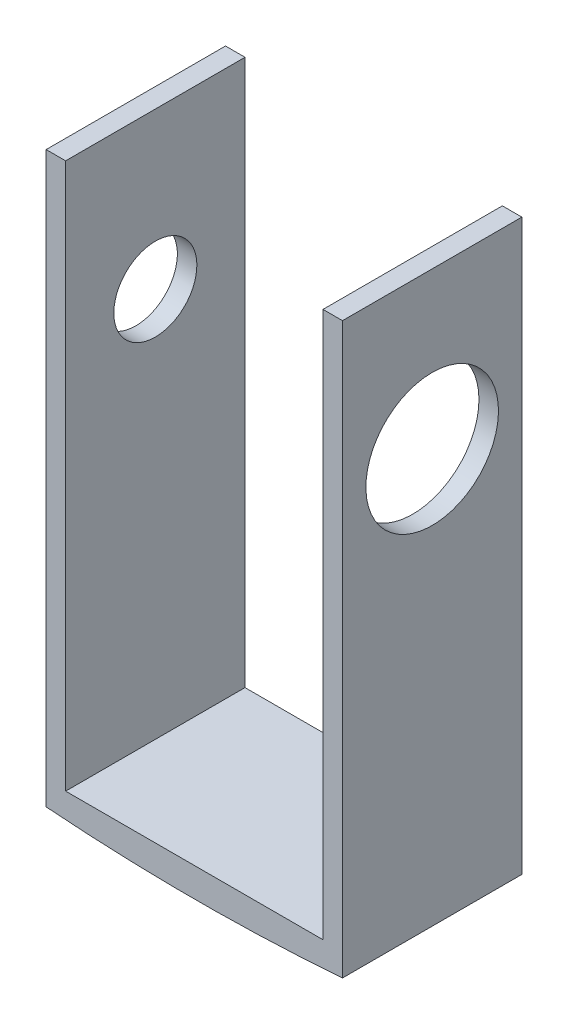
ISO-10303-21;
HEADER;
FILE_DESCRIPTION(('STEP AP214'),'2;1');
FILE_NAME('part.step','',(''),(''),'','','');
FILE_SCHEMA(('AUTOMOTIVE_DESIGN { 1 0 10303 214 1 1 1 1 }'));
ENDSEC;
DATA;
#1=APPLICATION_CONTEXT('core data for automotive mechanical design processes');
#2=APPLICATION_PROTOCOL_DEFINITION('international standard','automotive_design',2000,#1);
#3=PRODUCT_CONTEXT('',#1,'mechanical');
#4=PRODUCT('Part','Part','',(#3));
#5=PRODUCT_RELATED_PRODUCT_CATEGORY('part','',(#4));
#6=PRODUCT_DEFINITION_FORMATION('','',#4);
#7=PRODUCT_DEFINITION_CONTEXT('part definition',#1,'design');
#8=PRODUCT_DEFINITION('design','',#6,#7);
#9=PRODUCT_DEFINITION_SHAPE('','',#8);
#10=(LENGTH_UNIT() NAMED_UNIT(*) SI_UNIT(.MILLI.,.METRE.));
#11=(NAMED_UNIT(*) PLANE_ANGLE_UNIT() SI_UNIT($,.RADIAN.));
#12=(NAMED_UNIT(*) SI_UNIT($,.STERADIAN.) SOLID_ANGLE_UNIT());
#13=UNCERTAINTY_MEASURE_WITH_UNIT(LENGTH_MEASURE(1.E-05),#10,'distance_accuracy_value','');
#14=(GEOMETRIC_REPRESENTATION_CONTEXT(3) GLOBAL_UNCERTAINTY_ASSIGNED_CONTEXT((#13)) GLOBAL_UNIT_ASSIGNED_CONTEXT((#10,
#11,#12)) REPRESENTATION_CONTEXT('',''));
#15=CARTESIAN_POINT('',(0.,0.,0.));
#16=DIRECTION('',(0.,0.,1.));
#17=DIRECTION('',(1.,0.,0.));
#18=AXIS2_PLACEMENT_3D('',#15,#16,#17);
#19=CARTESIAN_POINT('',(-2.39943661770775,16.2501866197183,5.842));
#20=DIRECTION('',(0.,-1.,0.));
#21=DIRECTION('',(0.,0.,-1.));
#22=AXIS2_PLACEMENT_3D('',#19,#20,#21);
#23=PLANE('',#22);
#24=DIRECTION('',(-1.,0.,0.));
#25=VECTOR('',#24,1.);
#26=CARTESIAN_POINT('',(-2.39943661770775,16.2501866197183,0.));
#27=LINE('',#26,#25);
#28=CARTESIAN_POINT('',(-2.39943661770775,16.2501866197183,0.));
#29=VERTEX_POINT('',#28);
#30=CARTESIAN_POINT('',(-3.03443661770775,16.2501866197183,0.));
#31=VERTEX_POINT('',#30);
#32=EDGE_CURVE('E140',#29,#31,#27,.T.);
#33=ORIENTED_EDGE('',*,*,#32,.T.);
#34=DIRECTION('',(0.,0.,-1.));
#35=VECTOR('',#34,1.);
#36=CARTESIAN_POINT('',(-3.03443661770775,16.2501866197183,5.842));
#37=LINE('',#36,#35);
#38=CARTESIAN_POINT('',(-3.03443661770775,16.2501866197183,5.842));
#39=VERTEX_POINT('',#38);
#40=EDGE_CURVE('E11',#39,#31,#37,.T.);
#41=ORIENTED_EDGE('',*,*,#40,.F.);
#42=DIRECTION('',(-1.,0.,0.));
#43=VECTOR('',#42,1.);
#44=CARTESIAN_POINT('',(-2.39943661770775,16.2501866197183,5.842));
#45=LINE('',#44,#43);
#46=CARTESIAN_POINT('',(-2.39943661770775,16.2501866197183,5.842));
#47=VERTEX_POINT('',#46);
#48=EDGE_CURVE('E160',#47,#39,#45,.T.);
#49=ORIENTED_EDGE('',*,*,#48,.F.);
#50=DIRECTION('',(0.,0.,-1.));
#51=VECTOR('',#50,1.);
#52=CARTESIAN_POINT('',(-2.39943661770775,16.2501866197183,5.842));
#53=LINE('',#52,#51);
#54=EDGE_CURVE('E136',#47,#29,#53,.T.);
#55=ORIENTED_EDGE('',*,*,#54,.T.);
#56=EDGE_LOOP('',(#33,#41,#49,#55));
#57=FACE_BOUND('',#56,.T.);
#58=ADVANCED_FACE('F39',(#57),#23,.F.);
#59=CARTESIAN_POINT('',(-3.03443661770775,16.2501866197183,5.842));
#60=DIRECTION('',(1.,0.,0.));
#61=DIRECTION('',(0.,1.,0.));
#62=AXIS2_PLACEMENT_3D('',#59,#60,#61);
#63=PLANE('',#62);
#64=CARTESIAN_POINT('',(-3.03443661770775,11.1701866197183,2.921));
#65=DIRECTION('',(-1.,0.,0.));
#66=DIRECTION('',(0.,0.,1.));
#67=AXIS2_PLACEMENT_3D('',#64,#65,#66);
#68=CIRCLE('',#67,1.35254999999999);
#69=CARTESIAN_POINT('',(-3.03443661770775,11.1701866197183,4.27354999999999));
#70=VERTEX_POINT('',#69);
#71=EDGE_CURVE('E333',#70,#70,#68,.T.);
#72=ORIENTED_EDGE('',*,*,#71,.F.);
#73=EDGE_LOOP('',(#72));
#74=FACE_BOUND('',#73,.T.);
#75=DIRECTION('',(0.,-1.,0.));
#76=VECTOR('',#75,1.);
#77=CARTESIAN_POINT('',(-3.03443661770775,16.2501866197183,0.));
#78=LINE('',#77,#76);
#79=CARTESIAN_POINT('',(-3.03443661770775,-2.29181338028169,0.));
#80=VERTEX_POINT('',#79);
#81=EDGE_CURVE('E144',#31,#80,#78,.T.);
#82=ORIENTED_EDGE('',*,*,#81,.T.);
#83=DIRECTION('',(0.,0.,-1.));
#84=VECTOR('',#83,1.);
#85=CARTESIAN_POINT('',(-3.03443661770775,-2.29181338028169,5.842));
#86=LINE('',#85,#84);
#87=CARTESIAN_POINT('',(-3.03443661770775,-2.29181338028169,5.842));
#88=VERTEX_POINT('',#87);
#89=EDGE_CURVE('E49',#88,#80,#86,.T.);
#90=ORIENTED_EDGE('',*,*,#89,.F.);
#91=DIRECTION('',(0.,-1.,0.));
#92=VECTOR('',#91,1.);
#93=CARTESIAN_POINT('',(-3.03443661770775,16.2501866197183,5.842));
#94=LINE('',#93,#92);
#95=EDGE_CURVE('E98',#39,#88,#94,.T.);
#96=ORIENTED_EDGE('',*,*,#95,.F.);
#97=ORIENTED_EDGE('',*,*,#40,.T.);
#98=EDGE_LOOP('',(#82,#90,#96,#97));
#99=FACE_BOUND('',#98,.T.);
#100=ADVANCED_FACE('F227',(#74,#99),#63,.F.);
#101=CARTESIAN_POINT('',(6.61756338229225,-2.29181338028169,5.842));
#102=DIRECTION('',(-1.,0.,0.));
#103=DIRECTION('',(0.,-1.,0.));
#104=AXIS2_PLACEMENT_3D('',#101,#102,#103);
#105=PLANE('',#104);
#106=CARTESIAN_POINT('',(6.61756338229225,11.1701866197183,2.921));
#107=DIRECTION('',(1.,0.,0.));
#108=DIRECTION('',(0.,1.,0.));
#109=AXIS2_PLACEMENT_3D('',#106,#107,#108);
#110=CIRCLE('',#109,2.159);
#111=CARTESIAN_POINT('',(6.61756338229225,13.3291866197183,2.921));
#112=VERTEX_POINT('',#111);
#113=EDGE_CURVE('E196',#112,#112,#110,.T.);
#114=ORIENTED_EDGE('',*,*,#113,.F.);
#115=EDGE_LOOP('',(#114));
#116=FACE_BOUND('',#115,.T.);
#117=DIRECTION('',(0.,1.,0.));
#118=VECTOR('',#117,1.);
#119=CARTESIAN_POINT('',(6.61756338229225,-2.29181338028169,0.));
#120=LINE('',#119,#118);
#121=CARTESIAN_POINT('',(6.61756338229219,-2.29181338028169,0.));
#122=VERTEX_POINT('',#121);
#123=CARTESIAN_POINT('',(6.61756338229225,16.2501866197183,0.));
#124=VERTEX_POINT('',#123);
#125=EDGE_CURVE('E148',#122,#124,#120,.T.);
#126=ORIENTED_EDGE('',*,*,#125,.T.);
#127=DIRECTION('',(0.,0.,-1.));
#128=VECTOR('',#127,1.);
#129=CARTESIAN_POINT('',(6.61756338229225,16.2501866197183,5.842));
#130=LINE('',#129,#128);
#131=CARTESIAN_POINT('',(6.61756338229225,16.2501866197183,5.842));
#132=VERTEX_POINT('',#131);
#133=EDGE_CURVE('E167',#132,#124,#130,.T.);
#134=ORIENTED_EDGE('',*,*,#133,.F.);
#135=DIRECTION('',(0.,1.,0.));
#136=VECTOR('',#135,1.);
#137=CARTESIAN_POINT('',(6.61756338229225,-2.29181338028169,5.842));
#138=LINE('',#137,#136);
#139=CARTESIAN_POINT('',(6.61756338229225,-2.29181338028169,5.842));
#140=VERTEX_POINT('',#139);
#141=EDGE_CURVE('E203',#140,#132,#138,.T.);
#142=ORIENTED_EDGE('',*,*,#141,.F.);
#143=DIRECTION('',(0.,0.,-1.));
#144=VECTOR('',#143,1.);
#145=CARTESIAN_POINT('',(6.61756338229225,-2.29181338028169,5.842));
#146=LINE('',#145,#144);
#147=EDGE_CURVE('E171',#140,#122,#146,.T.);
#148=ORIENTED_EDGE('',*,*,#147,.T.);
#149=EDGE_LOOP('',(#126,#134,#142,#148));
#150=FACE_BOUND('',#149,.T.);
#151=ADVANCED_FACE('F208',(#116,#150),#105,.F.);
#152=CARTESIAN_POINT('',(5.98256338229225,16.2501866197183,5.842));
#153=DIRECTION('',(0.,-1.,0.));
#154=DIRECTION('',(0.,0.,-1.));
#155=AXIS2_PLACEMENT_3D('',#152,#153,#154);
#156=PLANE('',#155);
#157=DIRECTION('',(-1.,0.,0.));
#158=VECTOR('',#157,1.);
#159=CARTESIAN_POINT('',(5.98256338229225,16.2501866197183,0.));
#160=LINE('',#159,#158);
#161=CARTESIAN_POINT('',(5.98256338229225,16.2501866197183,0.));
#162=VERTEX_POINT('',#161);
#163=EDGE_CURVE('E151',#124,#162,#160,.T.);
#164=ORIENTED_EDGE('',*,*,#163,.T.);
#165=DIRECTION('',(0.,0.,-1.));
#166=VECTOR('',#165,1.);
#167=CARTESIAN_POINT('',(5.98256338229225,16.2501866197183,5.842));
#168=LINE('',#167,#166);
#169=CARTESIAN_POINT('',(5.98256338229225,16.2501866197183,5.842));
#170=VERTEX_POINT('',#169);
#171=EDGE_CURVE('E129',#170,#162,#168,.T.);
#172=ORIENTED_EDGE('',*,*,#171,.F.);
#173=DIRECTION('',(-1.,0.,0.));
#174=VECTOR('',#173,1.);
#175=CARTESIAN_POINT('',(5.98256338229225,16.2501866197183,5.842));
#176=LINE('',#175,#174);
#177=EDGE_CURVE('E118',#132,#170,#176,.T.);
#178=ORIENTED_EDGE('',*,*,#177,.F.);
#179=ORIENTED_EDGE('',*,*,#133,.T.);
#180=EDGE_LOOP('',(#164,#172,#178,#179));
#181=FACE_BOUND('',#180,.T.);
#182=ADVANCED_FACE('F210',(#181),#156,.F.);
#183=CARTESIAN_POINT('',(5.98256338229225,16.2501866197183,5.842));
#184=DIRECTION('',(1.,0.,0.));
#185=DIRECTION('',(0.,0.,-1.));
#186=AXIS2_PLACEMENT_3D('',#183,#184,#185);
#187=PLANE('',#186);
#188=CARTESIAN_POINT('',(5.98256338229225,11.1701866197183,2.921));
#189=DIRECTION('',(1.,0.,0.));
#190=DIRECTION('',(0.,0.,-1.));
#191=AXIS2_PLACEMENT_3D('',#188,#189,#190);
#192=CIRCLE('',#191,2.159);
#193=CARTESIAN_POINT('',(5.98256338229225,11.1701866197183,0.762));
#194=VERTEX_POINT('',#193);
#195=EDGE_CURVE('E42',#194,#194,#192,.T.);
#196=ORIENTED_EDGE('',*,*,#195,.T.);
#197=EDGE_LOOP('',(#196));
#198=FACE_BOUND('',#197,.T.);
#199=DIRECTION('',(0.,-1.,0.));
#200=VECTOR('',#199,1.);
#201=CARTESIAN_POINT('',(5.98256338229225,16.2501866197183,0.));
#202=LINE('',#201,#200);
#203=CARTESIAN_POINT('',(5.98256338229225,-1.52981338028169,0.));
#204=VERTEX_POINT('',#203);
#205=EDGE_CURVE('E127',#162,#204,#202,.T.);
#206=ORIENTED_EDGE('',*,*,#205,.T.);
#207=DIRECTION('',(0.,0.,-1.));
#208=VECTOR('',#207,1.);
#209=CARTESIAN_POINT('',(5.98256338229225,-1.52981338028169,5.842));
#210=LINE('',#209,#208);
#211=CARTESIAN_POINT('',(5.98256338229225,-1.52981338028169,5.842));
#212=VERTEX_POINT('',#211);
#213=EDGE_CURVE('E124',#212,#204,#210,.T.);
#214=ORIENTED_EDGE('',*,*,#213,.F.);
#215=DIRECTION('',(0.,-1.,0.));
#216=VECTOR('',#215,1.);
#217=CARTESIAN_POINT('',(5.98256338229225,16.2501866197183,5.842));
#218=LINE('',#217,#216);
#219=EDGE_CURVE('E112',#170,#212,#218,.T.);
#220=ORIENTED_EDGE('',*,*,#219,.F.);
#221=ORIENTED_EDGE('',*,*,#171,.T.);
#222=EDGE_LOOP('',(#206,#214,#220,#221));
#223=FACE_BOUND('',#222,.T.);
#224=ADVANCED_FACE('F125',(#198,#223),#187,.F.);
#225=CARTESIAN_POINT('',(5.98256338229225,-1.52981338028169,5.842));
#226=DIRECTION('',(0.,-1.,0.));
#227=DIRECTION('',(1.,0.,0.));
#228=AXIS2_PLACEMENT_3D('',#225,#226,#227);
#229=PLANE('',#228);
#230=DIRECTION('',(-1.,0.,0.));
#231=VECTOR('',#230,1.);
#232=CARTESIAN_POINT('',(5.98256338229225,-1.52981338028169,0.));
#233=LINE('',#232,#231);
#234=CARTESIAN_POINT('',(-2.39943661770775,-1.52981338028169,0.));
#235=VERTEX_POINT('',#234);
#236=EDGE_CURVE('E84',#204,#235,#233,.T.);
#237=ORIENTED_EDGE('',*,*,#236,.T.);
#238=DIRECTION('',(0.,0.,-1.));
#239=VECTOR('',#238,1.);
#240=CARTESIAN_POINT('',(-2.39943661770775,-1.52981338028169,5.842));
#241=LINE('',#240,#239);
#242=CARTESIAN_POINT('',(-2.39943661770775,-1.52981338028169,5.842));
#243=VERTEX_POINT('',#242);
#244=EDGE_CURVE('E130',#243,#235,#241,.T.);
#245=ORIENTED_EDGE('',*,*,#244,.F.);
#246=DIRECTION('',(-1.,0.,0.));
#247=VECTOR('',#246,1.);
#248=CARTESIAN_POINT('',(5.98256338229225,-1.52981338028169,5.842));
#249=LINE('',#248,#247);
#250=EDGE_CURVE('E116',#212,#243,#249,.T.);
#251=ORIENTED_EDGE('',*,*,#250,.F.);
#252=ORIENTED_EDGE('',*,*,#213,.T.);
#253=EDGE_LOOP('',(#237,#245,#251,#252));
#254=FACE_BOUND('',#253,.T.);
#255=ADVANCED_FACE('F132',(#254),#229,.F.);
#256=CARTESIAN_POINT('',(-2.39943661770775,-1.52981338028169,5.842));
#257=DIRECTION('',(-1.,0.,0.));
#258=DIRECTION('',(0.,-1.,0.));
#259=AXIS2_PLACEMENT_3D('',#256,#257,#258);
#260=PLANE('',#259);
#261=CARTESIAN_POINT('',(-2.39943661770775,11.1701866197183,2.921));
#262=DIRECTION('',(-1.,0.,0.));
#263=DIRECTION('',(0.,-1.,0.));
#264=AXIS2_PLACEMENT_3D('',#261,#262,#263);
#265=CIRCLE('',#264,1.35254999999999);
#266=CARTESIAN_POINT('',(-2.39943661770775,9.81763661971832,2.921));
#267=VERTEX_POINT('',#266);
#268=EDGE_CURVE('E331',#267,#267,#265,.T.);
#269=ORIENTED_EDGE('',*,*,#268,.T.);
#270=EDGE_LOOP('',(#269));
#271=FACE_BOUND('',#270,.T.);
#272=DIRECTION('',(0.,1.,0.));
#273=VECTOR('',#272,1.);
#274=CARTESIAN_POINT('',(-2.39943661770775,-1.52981338028169,0.));
#275=LINE('',#274,#273);
#276=EDGE_CURVE('E90',#235,#29,#275,.T.);
#277=ORIENTED_EDGE('',*,*,#276,.T.);
#278=ORIENTED_EDGE('',*,*,#54,.F.);
#279=DIRECTION('',(0.,1.,0.));
#280=VECTOR('',#279,1.);
#281=CARTESIAN_POINT('',(-2.39943661770775,-1.52981338028169,5.842));
#282=LINE('',#281,#280);
#283=EDGE_CURVE('E57',#243,#47,#282,.T.);
#284=ORIENTED_EDGE('',*,*,#283,.F.);
#285=ORIENTED_EDGE('',*,*,#244,.T.);
#286=EDGE_LOOP('',(#277,#278,#284,#285));
#287=FACE_BOUND('',#286,.T.);
#288=ADVANCED_FACE('F214',(#271,#287),#260,.F.);
#289=CARTESIAN_POINT('',(0.,0.,5.842));
#290=DIRECTION('',(0.,0.,1.));
#291=DIRECTION('',(1.,0.,0.));
#292=AXIS2_PLACEMENT_3D('',#289,#290,#291);
#293=PLANE('',#292);
#294=ORIENTED_EDGE('',*,*,#48,.T.);
#295=ORIENTED_EDGE('',*,*,#95,.T.);
#296=CARTESIAN_POINT('',(1.79156338229224,60.260295840751,5.842));
#297=DIRECTION('',(0.,0.,1.));
#298=DIRECTION('',(1.,0.,0.));
#299=AXIS2_PLACEMENT_3D('',#296,#297,#298);
#300=CIRCLE('',#299,62.738);
#301=EDGE_CURVE('E145',#88,#140,#300,.T.);
#302=ORIENTED_EDGE('',*,*,#301,.T.);
#303=ORIENTED_EDGE('',*,*,#141,.T.);
#304=ORIENTED_EDGE('',*,*,#177,.T.);
#305=ORIENTED_EDGE('',*,*,#219,.T.);
#306=ORIENTED_EDGE('',*,*,#250,.T.);
#307=ORIENTED_EDGE('',*,*,#283,.T.);
#308=EDGE_LOOP('',(#294,#295,#302,#303,#304,#305,#306,#307));
#309=FACE_BOUND('',#308,.T.);
#310=ADVANCED_FACE('F114',(#309),#293,.T.);
#311=CARTESIAN_POINT('',(0.,0.,0.));
#312=DIRECTION('',(0.,0.,1.));
#313=DIRECTION('',(1.,0.,0.));
#314=AXIS2_PLACEMENT_3D('',#311,#312,#313);
#315=PLANE('',#314);
#316=ORIENTED_EDGE('',*,*,#32,.F.);
#317=ORIENTED_EDGE('',*,*,#276,.F.);
#318=ORIENTED_EDGE('',*,*,#236,.F.);
#319=ORIENTED_EDGE('',*,*,#205,.F.);
#320=ORIENTED_EDGE('',*,*,#163,.F.);
#321=ORIENTED_EDGE('',*,*,#125,.F.);
#322=CARTESIAN_POINT('',(1.79156338229224,60.260295840751,0.));
#323=DIRECTION('',(0.,0.,1.));
#324=DIRECTION('',(1.,0.,0.));
#325=AXIS2_PLACEMENT_3D('',#322,#323,#324);
#326=CIRCLE('',#325,62.738);
#327=EDGE_CURVE('E183',#80,#122,#326,.T.);
#328=ORIENTED_EDGE('',*,*,#327,.F.);
#329=ORIENTED_EDGE('',*,*,#81,.F.);
#330=EDGE_LOOP('',(#316,#317,#318,#319,#320,#321,#328,#329));
#331=FACE_BOUND('',#330,.T.);
#332=ADVANCED_FACE('F188',(#331),#315,.F.);
#333=CARTESIAN_POINT('',(1.79156338229224,60.260295840751,5.842));
#334=DIRECTION('',(0.,0.,-1.));
#335=DIRECTION('',(-1.,0.,0.));
#336=AXIS2_PLACEMENT_3D('',#333,#334,#335);
#337=CYLINDRICAL_SURFACE('',#336,62.738);
#338=ORIENTED_EDGE('',*,*,#327,.T.);
#339=ORIENTED_EDGE('',*,*,#147,.F.);
#340=ORIENTED_EDGE('',*,*,#301,.F.);
#341=ORIENTED_EDGE('',*,*,#89,.T.);
#342=EDGE_LOOP('',(#338,#339,#340,#341));
#343=FACE_BOUND('',#342,.T.);
#344=ADVANCED_FACE('F181',(#343),#337,.T.);
#345=CARTESIAN_POINT('',(4.07756338229225,11.1701866197183,2.921));
#346=DIRECTION('',(1.,0.,0.));
#347=DIRECTION('',(0.,1.,0.));
#348=AXIS2_PLACEMENT_3D('',#345,#346,#347);
#349=CYLINDRICAL_SURFACE('',#348,2.159);
#350=ORIENTED_EDGE('',*,*,#113,.T.);
#351=EDGE_LOOP('',(#350));
#352=FACE_BOUND('',#351,.T.);
#353=ORIENTED_EDGE('',*,*,#195,.F.);
#354=EDGE_LOOP('',(#353));
#355=FACE_BOUND('',#354,.T.);
#356=ADVANCED_FACE('F247',(#352,#355),#349,.F.);
#357=CARTESIAN_POINT('',(-3.03443661770775,11.1701866197183,2.921));
#358=DIRECTION('',(-1.,0.,0.));
#359=DIRECTION('',(0.,0.,1.));
#360=AXIS2_PLACEMENT_3D('',#357,#358,#359);
#361=CYLINDRICAL_SURFACE('',#360,1.35254999999999);
#362=ORIENTED_EDGE('',*,*,#268,.F.);
#363=EDGE_LOOP('',(#362));
#364=FACE_BOUND('',#363,.T.);
#365=ORIENTED_EDGE('',*,*,#71,.T.);
#366=EDGE_LOOP('',(#365));
#367=FACE_BOUND('',#366,.T.);
#368=ADVANCED_FACE('F249',(#364,#367),#361,.F.);
#369=CLOSED_SHELL('',(#58,#100,#151,#182,#224,#255,#288,#310,#332,#344,#356,#368));
#370=MANIFOLD_SOLID_BREP('B2',#369);
#371=ADVANCED_BREP_SHAPE_REPRESENTATION('',(#18,#370),#14);
#372=SHAPE_DEFINITION_REPRESENTATION(#9,#371);
ENDSEC;
END-ISO-10303-21;
